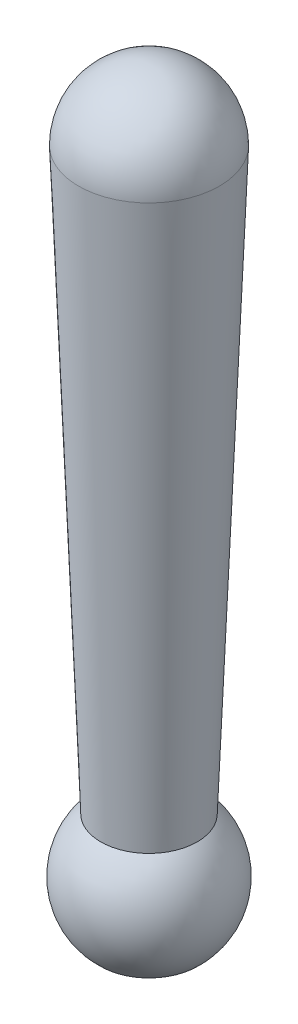
ISO-10303-21;
HEADER;
FILE_DESCRIPTION(('STEP AP214'),'2;1');
FILE_NAME('part.step','',(''),(''),'','','');
FILE_SCHEMA(('AUTOMOTIVE_DESIGN { 1 0 10303 214 1 1 1 1 }'));
ENDSEC;
DATA;
#1=APPLICATION_CONTEXT('core data for automotive mechanical design processes');
#2=APPLICATION_PROTOCOL_DEFINITION('international standard','automotive_design',2000,#1);
#3=PRODUCT_CONTEXT('',#1,'mechanical');
#4=PRODUCT('Part','Part','',(#3));
#5=PRODUCT_RELATED_PRODUCT_CATEGORY('part','',(#4));
#6=PRODUCT_DEFINITION_FORMATION('','',#4);
#7=PRODUCT_DEFINITION_CONTEXT('part definition',#1,'design');
#8=PRODUCT_DEFINITION('design','',#6,#7);
#9=PRODUCT_DEFINITION_SHAPE('','',#8);
#10=(LENGTH_UNIT() NAMED_UNIT(*) SI_UNIT(.MILLI.,.METRE.));
#11=(NAMED_UNIT(*) PLANE_ANGLE_UNIT() SI_UNIT($,.RADIAN.));
#12=(NAMED_UNIT(*) SI_UNIT($,.STERADIAN.) SOLID_ANGLE_UNIT());
#13=UNCERTAINTY_MEASURE_WITH_UNIT(LENGTH_MEASURE(1.E-05),#10,'distance_accuracy_value','');
#14=(GEOMETRIC_REPRESENTATION_CONTEXT(3) GLOBAL_UNCERTAINTY_ASSIGNED_CONTEXT((#13)) GLOBAL_UNIT_ASSIGNED_CONTEXT((#10,
#11,#12)) REPRESENTATION_CONTEXT('',''));
#15=CARTESIAN_POINT('',(0.,0.,0.));
#16=DIRECTION('',(0.,0.,1.));
#17=DIRECTION('',(1.,0.,0.));
#18=AXIS2_PLACEMENT_3D('',#15,#16,#17);
#19=CARTESIAN_POINT('',(0.,0.,0.));
#20=DIRECTION('',(0.,0.,1.));
#21=DIRECTION('',(1.,0.,0.));
#22=AXIS2_PLACEMENT_3D('',#19,#20,#21);
#23=SPHERICAL_SURFACE('',#22,1.46);
#24=CARTESIAN_POINT('',(0.,0.,0.));
#25=DIRECTION('',(0.,-1.,0.));
#26=DIRECTION('',(0.,0.,-1.));
#27=AXIS2_PLACEMENT_3D('',#24,#25,#26);
#28=SPHERICAL_SURFACE('',#27,1.46);
#29=CARTESIAN_POINT('',(0.,1.70176372993325E-12,0.));
#30=DIRECTION('',(0.,-1.,0.));
#31=DIRECTION('',(0.,0.,-1.));
#32=AXIS2_PLACEMENT_3D('',#29,#30,#31);
#33=CIRCLE('',#32,1.46000000000007);
#34=CARTESIAN_POINT('',(0.,1.70176372993325E-12,-1.46000000000007));
#35=VERTEX_POINT('',#34);
#36=EDGE_CURVE('E11',#35,#35,#33,.F.);
#37=ORIENTED_EDGE('',*,*,#36,.T.);
#38=EDGE_LOOP('',(#37));
#39=FACE_BOUND('',#38,.T.);
#40=ADVANCED_FACE('F34',(#39),#28,.T.);
#41=CARTESIAN_POINT('',(0.,-12.,0.));
#42=DIRECTION('',(0.,1.,0.));
#43=DIRECTION('',(0.,0.,1.));
#44=AXIS2_PLACEMENT_3D('',#41,#42,#43);
#45=CONICAL_SURFACE('',#44,1.,0.0383145736357899);
#46=ORIENTED_EDGE('',*,*,#36,.F.);
#47=EDGE_LOOP('',(#46));
#48=FACE_BOUND('',#47,.T.);
#49=CARTESIAN_POINT('',(0.,-12.,0.));
#50=DIRECTION('',(0.,1.,0.));
#51=DIRECTION('',(-1.,0.,0.));
#52=AXIS2_PLACEMENT_3D('',#49,#50,#51);
#53=CIRCLE('',#52,1.);
#54=CARTESIAN_POINT('',(0.999999999999999,-12.,0.));
#55=VERTEX_POINT('',#54);
#56=EDGE_CURVE('E41',#55,#55,#53,.T.);
#57=ORIENTED_EDGE('',*,*,#56,.T.);
#58=EDGE_LOOP('',(#57));
#59=FACE_BOUND('',#58,.T.);
#60=ADVANCED_FACE('F68',(#48,#59),#45,.T.);
#61=CARTESIAN_POINT('',(0.,-13.1180339887499,0.));
#62=DIRECTION('',(0.,1.,0.));
#63=DIRECTION('',(1.,0.,0.));
#64=AXIS2_PLACEMENT_3D('',#61,#62,#63);
#65=SPHERICAL_SURFACE('',#64,1.5);
#66=CARTESIAN_POINT('',(0.,-14.2360679774998,0.));
#67=DIRECTION('',(0.,1.,0.));
#68=DIRECTION('',(-1.,0.,0.));
#69=AXIS2_PLACEMENT_3D('',#66,#67,#68);
#70=CIRCLE('',#69,1.);
#71=CARTESIAN_POINT('',(1.,-14.2360679774998,0.));
#72=VERTEX_POINT('',#71);
#73=EDGE_CURVE('E46',#72,#72,#70,.T.);
#74=CARTESIAN_POINT('',(0.999999999999999,-12.,0.));
#75=CARTESIAN_POINT('',(1.01959096907781,-12.017521776987,0.));
#76=CARTESIAN_POINT('',(1.03872045051323,-12.0355594192632,0.));
#77=CARTESIAN_POINT('',(1.07600571191281,-12.0726144683085,0.));
#78=CARTESIAN_POINT('',(1.09416149187697,-12.0916318750776,0.));
#79=CARTESIAN_POINT('',(1.12944862414752,-12.1305944870231,0.));
#80=CARTESIAN_POINT('',(1.1465799764539,-12.1505396921995,0.));
#81=CARTESIAN_POINT('',(1.1797710781159,-12.1913026464436,0.));
#82=CARTESIAN_POINT('',(1.1958308274715,-12.2121203955113,0.));
#83=CARTESIAN_POINT('',(1.22683431525106,-12.2545709668392,0.));
#84=CARTESIAN_POINT('',(1.24177805367503,-12.2762037890993,0.));
#85=CARTESIAN_POINT('',(1.27050824648677,-12.3202247322946,0.));
#86=CARTESIAN_POINT('',(1.28429470087456,-12.3426128532297,0.));
#87=CARTESIAN_POINT('',(1.31067223579234,-12.3880825465985,0.));
#88=CARTESIAN_POINT('',(1.32326331632234,-12.4111641190321,0.));
#89=CARTESIAN_POINT('',(1.34721531979571,-12.4579569487316,0.));
#90=CARTESIAN_POINT('',(1.35857624273909,-12.4816682059976,0.));
#91=CARTESIAN_POINT('',(1.38003654478674,-12.5296549001106,0.));
#92=CARTESIAN_POINT('',(1.39013592389103,-12.5539303369576,0.));
#93=CARTESIAN_POINT('',(1.4090452374554,-12.6029783260926,0.));
#94=CARTESIAN_POINT('',(1.41785517191547,-12.6277508783807,0.));
#95=CARTESIAN_POINT('',(1.43416125757504,-12.677724660983,0.));
#96=CARTESIAN_POINT('',(1.44165740877453,-12.7029258912973,0.));
#97=CARTESIAN_POINT('',(1.45531521881454,-12.7536874082387,0.));
#98=CARTESIAN_POINT('',(1.46147687765506,-12.7792476948658,0.));
#99=CARTESIAN_POINT('',(1.47244868058406,-12.8306567107845,0.));
#100=CARTESIAN_POINT('',(1.47725882467254,-12.856505440076,0.));
#101=CARTESIAN_POINT('',(1.48551430944282,-12.9084199308128,0.));
#102=CARTESIAN_POINT('',(1.48895965012462,-12.934485692258,0.));
#103=CARTESIAN_POINT('',(1.49447600987522,-12.9867622372122,0.));
#104=CARTESIAN_POINT('',(1.49654702894402,-13.0129730207212,0.));
#105=CARTESIAN_POINT('',(1.49930902400641,-13.06546719907,0.));
#106=CARTESIAN_POINT('',(1.5,-13.09175059391,0.));
#107=CARTESIAN_POINT('',(1.5,-13.1443173835898,0.));
#108=CARTESIAN_POINT('',(1.49930902400641,-13.1706007784298,0.));
#109=CARTESIAN_POINT('',(1.49654702894402,-13.2230949567786,0.));
#110=CARTESIAN_POINT('',(1.49447600987522,-13.2493057402876,0.));
#111=CARTESIAN_POINT('',(1.48895965012462,-13.3015822852418,0.));
#112=CARTESIAN_POINT('',(1.48551430944282,-13.327648046687,0.));
#113=CARTESIAN_POINT('',(1.47725882467254,-13.3795625374238,0.));
#114=CARTESIAN_POINT('',(1.47244868058406,-13.4054112667153,0.));
#115=CARTESIAN_POINT('',(1.46147687765506,-13.4568202826339,0.));
#116=CARTESIAN_POINT('',(1.45531521881454,-13.4823805692611,0.));
#117=CARTESIAN_POINT('',(1.44165740877453,-13.5331420862025,0.));
#118=CARTESIAN_POINT('',(1.43416125757504,-13.5583433165168,0.));
#119=CARTESIAN_POINT('',(1.41785517191547,-13.6083170991191,0.));
#120=CARTESIAN_POINT('',(1.4090452374554,-13.6330896514072,0.));
#121=CARTESIAN_POINT('',(1.39013592389103,-13.6821376405422,0.));
#122=CARTESIAN_POINT('',(1.38003654478675,-13.7064130773892,0.));
#123=CARTESIAN_POINT('',(1.35857624273909,-13.7543997715022,0.));
#124=CARTESIAN_POINT('',(1.34721531979571,-13.7781110287682,0.));
#125=CARTESIAN_POINT('',(1.32326331632234,-13.8249038584677,0.));
#126=CARTESIAN_POINT('',(1.31067223579234,-13.8479854309013,0.));
#127=CARTESIAN_POINT('',(1.28429470087456,-13.8934551242701,0.));
#128=CARTESIAN_POINT('',(1.27050824648678,-13.9158432452052,0.));
#129=CARTESIAN_POINT('',(1.24177805367503,-13.9598641884005,0.));
#130=CARTESIAN_POINT('',(1.22683431525106,-13.9814970106606,0.));
#131=CARTESIAN_POINT('',(1.1958308274715,-14.0239475819884,0.));
#132=CARTESIAN_POINT('',(1.1797710781159,-14.0447653310562,0.));
#133=CARTESIAN_POINT('',(1.14657997645391,-14.0855282853003,0.));
#134=CARTESIAN_POINT('',(1.12944862414752,-14.1054734904767,0.));
#135=CARTESIAN_POINT('',(1.09416149187697,-14.1444361024222,0.));
#136=CARTESIAN_POINT('',(1.07600571191282,-14.1634535091913,0.));
#137=CARTESIAN_POINT('',(1.03872045051324,-14.2005085582366,0.));
#138=CARTESIAN_POINT('',(1.01959096907781,-14.2185462005128,0.));
#139=CARTESIAN_POINT('',(1.,-14.2360679774998,0.));
#140=B_SPLINE_CURVE_WITH_KNOTS('',3,(#74,#75,#76,#77,#78,#79,#80,#81,#82,#83,#84,#85,#86,#87,
#88,#89,#90,#91,#92,#93,#94,#95,#96,#97,#98,#99,#100,#101,#102,#103,#104,#105,#106,#107,#108,
#109,#110,#111,#112,#113,#114,#115,#116,#117,#118,#119,#120,#121,#122,#123,#124,#125,#126,#127,
#128,#129,#130,#131,#132,#133,#134,#135,#136,#137,#138,#139),.UNSPECIFIED.,.F.,.F.,(4,2,2,2,2,2,
2,2,2,2,2,2,2,2,2,2,2,2,2,2,2,2,2,2,2,2,2,2,2,2,2,2,4),(0.,0.0788411096722209,0.157682219344443,
0.236523329016664,0.315364438688885,0.394205548361107,0.473046658033327,0.55188776770555,
0.630728877377771,0.709569987049992,0.788411096722214,0.867252206394435,0.946093316066655,
1.02493442573888,1.1037755354111,1.18261664508332,1.26145775475554,1.34029886442776,
1.41913997409998,1.49798108377221,1.57682219344443,1.65566330311665,1.73450441278887,
1.81334552246109,1.89218663213331,1.97102774180553,2.04986885147775,2.12870996114998,
2.2075510708222,2.28639218049442,2.36523329016664,2.44407439983886,2.52291550951108),.UNSPECIFIED.);
#141=EDGE_CURVE('BSEAM58',#55,#72,#140,.T.);
#142=ORIENTED_EDGE('',*,*,#56,.F.);
#143=ORIENTED_EDGE('',*,*,#73,.T.);
#144=ORIENTED_EDGE('',*,*,#141,.T.);
#145=ORIENTED_EDGE('',*,*,#141,.F.);
#146=EDGE_LOOP('',(#142,#144,#143,#145));
#147=FACE_BOUND('',#146,.T.);
#148=ADVANCED_FACE('F58',(#147),#65,.T.);
#149=CARTESIAN_POINT('',(0.,-14.2360679774998,0.));
#150=DIRECTION('',(0.,1.,0.));
#151=DIRECTION('',(-1.,0.,0.));
#152=AXIS2_PLACEMENT_3D('',#149,#150,#151);
#153=PLANE('',#152);
#154=ORIENTED_EDGE('',*,*,#73,.F.);
#155=EDGE_LOOP('',(#154));
#156=FACE_BOUND('',#155,.T.);
#157=ADVANCED_FACE('F67',(#156),#153,.F.);
#158=CLOSED_SHELL('',(#40,#60,#148,#157));
#159=MANIFOLD_SOLID_BREP('B2',#158);
#160=ADVANCED_BREP_SHAPE_REPRESENTATION('',(#18,#159),#14);
#161=SHAPE_DEFINITION_REPRESENTATION(#9,#160);
ENDSEC;
END-ISO-10303-21;
